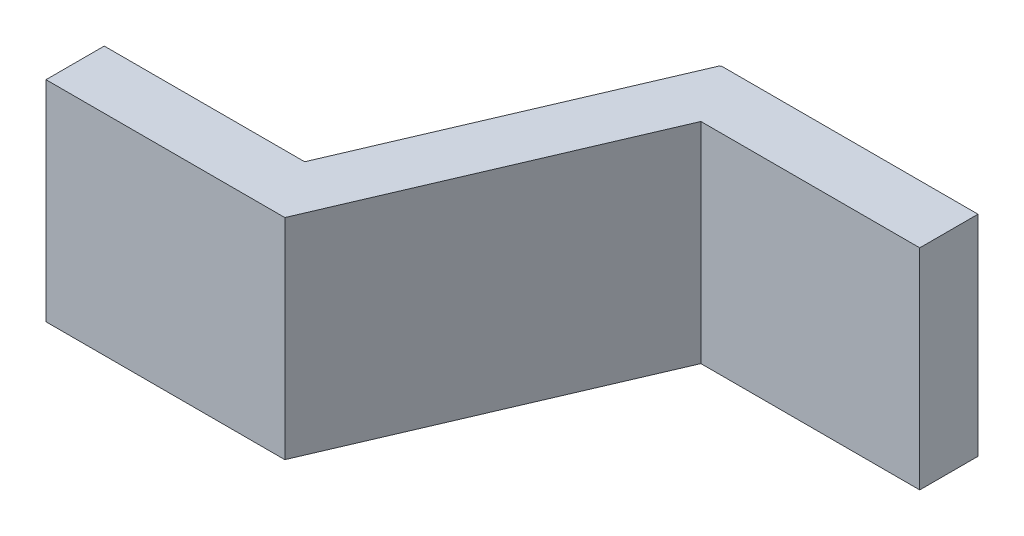
ISO-10303-21;
HEADER;
FILE_DESCRIPTION(('STEP AP214'),'2;1');
FILE_NAME('part.step','',(''),(''),'','','');
FILE_SCHEMA(('AUTOMOTIVE_DESIGN { 1 0 10303 214 1 1 1 1 }'));
ENDSEC;
DATA;
#1=APPLICATION_CONTEXT('core data for automotive mechanical design processes');
#2=APPLICATION_PROTOCOL_DEFINITION('international standard','automotive_design',2000,#1);
#3=PRODUCT_CONTEXT('',#1,'mechanical');
#4=PRODUCT('Part','Part','',(#3));
#5=PRODUCT_RELATED_PRODUCT_CATEGORY('part','',(#4));
#6=PRODUCT_DEFINITION_FORMATION('','',#4);
#7=PRODUCT_DEFINITION_CONTEXT('part definition',#1,'design');
#8=PRODUCT_DEFINITION('design','',#6,#7);
#9=PRODUCT_DEFINITION_SHAPE('','',#8);
#10=(LENGTH_UNIT() NAMED_UNIT(*) SI_UNIT(.MILLI.,.METRE.));
#11=(NAMED_UNIT(*) PLANE_ANGLE_UNIT() SI_UNIT($,.RADIAN.));
#12=(NAMED_UNIT(*) SI_UNIT($,.STERADIAN.) SOLID_ANGLE_UNIT());
#13=UNCERTAINTY_MEASURE_WITH_UNIT(LENGTH_MEASURE(1.E-05),#10,'distance_accuracy_value','');
#14=(GEOMETRIC_REPRESENTATION_CONTEXT(3) GLOBAL_UNCERTAINTY_ASSIGNED_CONTEXT((#13)) GLOBAL_UNIT_ASSIGNED_CONTEXT((#10,
#11,#12)) REPRESENTATION_CONTEXT('',''));
#15=CARTESIAN_POINT('',(0.,0.,0.));
#16=DIRECTION('',(0.,0.,1.));
#17=DIRECTION('',(1.,0.,0.));
#18=AXIS2_PLACEMENT_3D('',#15,#16,#17);
#19=CARTESIAN_POINT('',(11.558086453539,5.82,0.0006058345056003));
#20=DIRECTION('',(-0.919135450912914,0.,-0.393941649073963));
#21=DIRECTION('',(-0.393941649073963,0.,0.919135450912914));
#22=AXIS2_PLACEMENT_3D('',#19,#20,#21);
#23=PLANE('',#22);
#24=DIRECTION('',(0.,1.,0.));
#25=VECTOR('',#24,1.);
#26=CARTESIAN_POINT('',(11.344046008361,5.82,0.5));
#27=LINE('',#26,#25);
#28=CARTESIAN_POINT('',(11.344046008361,5.82,0.5));
#29=VERTEX_POINT('',#28);
#30=CARTESIAN_POINT('',(11.344046008361,6.180000014305,0.5));
#31=VERTEX_POINT('',#30);
#32=EDGE_CURVE('E94',#29,#31,#27,.T.);
#33=ORIENTED_EDGE('',*,*,#32,.T.);
#34=DIRECTION('',(-0.393941649073123,0.,0.919135450913275));
#35=VECTOR('',#34,1.);
#36=CARTESIAN_POINT('',(11.558086453539,6.180000014305,0.000605834505600302));
#37=LINE('',#36,#35);
#38=CARTESIAN_POINT('',(11.558086453539,6.180000014305,0.000605834505577237));
#39=VERTEX_POINT('',#38);
#40=EDGE_CURVE('E121',#39,#31,#37,.T.);
#41=ORIENTED_EDGE('',*,*,#40,.F.);
#42=DIRECTION('',(0.,1.,0.));
#43=VECTOR('',#42,1.);
#44=CARTESIAN_POINT('',(11.558086453539,5.82,0.000605834505554305));
#45=LINE('',#44,#43);
#46=CARTESIAN_POINT('',(11.558086453539,5.82,0.000605834505584969));
#47=VERTEX_POINT('',#46);
#48=EDGE_CURVE('E110',#39,#47,#45,.F.);
#49=ORIENTED_EDGE('',*,*,#48,.T.);
#50=DIRECTION('',(-0.393941649073123,0.,0.919135450913275));
#51=VECTOR('',#50,1.);
#52=CARTESIAN_POINT('',(11.558086453539,5.82,0.000605834505600302));
#53=LINE('',#52,#51);
#54=EDGE_CURVE('E100',#47,#29,#53,.T.);
#55=ORIENTED_EDGE('',*,*,#54,.T.);
#56=EDGE_LOOP('',(#33,#41,#49,#55));
#57=FACE_BOUND('',#56,.T.);
#58=ADVANCED_FACE('F17',(#57),#23,.T.);
#59=CARTESIAN_POINT('',(11.,5.82,0.5));
#60=DIRECTION('',(0.,0.,1.));
#61=DIRECTION('',(1.,0.,0.));
#62=AXIS2_PLACEMENT_3D('',#59,#60,#61);
#63=PLANE('',#62);
#64=DIRECTION('',(1.,0.,0.));
#65=VECTOR('',#64,1.);
#66=CARTESIAN_POINT('',(11.65,6.180000014305,0.5));
#67=LINE('',#66,#65);
#68=CARTESIAN_POINT('',(11.,6.180000014305,0.5));
#69=VERTEX_POINT('',#68);
#70=EDGE_CURVE('E79',#31,#69,#67,.F.);
#71=ORIENTED_EDGE('',*,*,#70,.F.);
#72=ORIENTED_EDGE('',*,*,#32,.F.);
#73=DIRECTION('',(1.,0.,0.));
#74=VECTOR('',#73,1.);
#75=CARTESIAN_POINT('',(11.65,5.82,0.5));
#76=LINE('',#75,#74);
#77=CARTESIAN_POINT('',(11.,5.82,0.5));
#78=VERTEX_POINT('',#77);
#79=EDGE_CURVE('E169',#29,#78,#76,.F.);
#80=ORIENTED_EDGE('',*,*,#79,.T.);
#81=DIRECTION('',(0.,1.,0.));
#82=VECTOR('',#81,1.);
#83=CARTESIAN_POINT('',(11.,5.82,0.5));
#84=LINE('',#83,#82);
#85=EDGE_CURVE('E87',#78,#69,#84,.T.);
#86=ORIENTED_EDGE('',*,*,#85,.T.);
#87=EDGE_LOOP('',(#71,#72,#80,#86));
#88=FACE_BOUND('',#87,.T.);
#89=ADVANCED_FACE('F198',(#88),#63,.F.);
#90=CARTESIAN_POINT('',(11.,5.82,0.5));
#91=DIRECTION('',(1.,0.,0.));
#92=DIRECTION('',(0.,0.,-1.));
#93=AXIS2_PLACEMENT_3D('',#90,#91,#92);
#94=PLANE('',#93);
#95=ORIENTED_EDGE('',*,*,#85,.F.);
#96=DIRECTION('',(0.,0.,1.));
#97=VECTOR('',#96,1.);
#98=CARTESIAN_POINT('',(11.,5.82,0.04));
#99=LINE('',#98,#97);
#100=CARTESIAN_POINT('',(11.,5.82,0.60000000149));
#101=VERTEX_POINT('',#100);
#102=EDGE_CURVE('E153',#78,#101,#99,.T.);
#103=ORIENTED_EDGE('',*,*,#102,.T.);
#104=DIRECTION('',(0.,1.,0.));
#105=VECTOR('',#104,1.);
#106=CARTESIAN_POINT('',(11.,5.82,0.60000000149));
#107=LINE('',#106,#105);
#108=CARTESIAN_POINT('',(11.,6.180000014305,0.60000000149));
#109=VERTEX_POINT('',#108);
#110=EDGE_CURVE('E117',#109,#101,#107,.F.);
#111=ORIENTED_EDGE('',*,*,#110,.F.);
#112=DIRECTION('',(0.,0.,1.));
#113=VECTOR('',#112,1.);
#114=CARTESIAN_POINT('',(11.,6.180000014305,0.04));
#115=LINE('',#114,#113);
#116=EDGE_CURVE('E71',#69,#109,#115,.T.);
#117=ORIENTED_EDGE('',*,*,#116,.F.);
#118=EDGE_LOOP('',(#95,#103,#111,#117));
#119=FACE_BOUND('',#118,.T.);
#120=ADVANCED_FACE('F202',(#119),#94,.F.);
#121=CARTESIAN_POINT('',(11.999999997616,5.82,0.));
#122=DIRECTION('',(1.,0.,0.));
#123=DIRECTION('',(0.,0.,-1.));
#124=AXIS2_PLACEMENT_3D('',#121,#122,#123);
#125=PLANE('',#124);
#126=DIRECTION('',(0.,0.,1.));
#127=VECTOR('',#126,1.);
#128=CARTESIAN_POINT('',(11.999999997616,5.82,0.04));
#129=LINE('',#128,#127);
#130=CARTESIAN_POINT('',(11.999999997616,5.82,0.10000000149));
#131=VERTEX_POINT('',#130);
#132=CARTESIAN_POINT('',(11.999999997616,5.82,0.));
#133=VERTEX_POINT('',#132);
#134=EDGE_CURVE('E179',#131,#133,#129,.F.);
#135=ORIENTED_EDGE('',*,*,#134,.T.);
#136=DIRECTION('',(0.,1.,0.));
#137=VECTOR('',#136,1.);
#138=CARTESIAN_POINT('',(11.999999997616,5.82,0.));
#139=LINE('',#138,#137);
#140=CARTESIAN_POINT('',(11.999999997616,6.180000014305,0.));
#141=VERTEX_POINT('',#140);
#142=EDGE_CURVE('E174',#133,#141,#139,.T.);
#143=ORIENTED_EDGE('',*,*,#142,.T.);
#144=DIRECTION('',(0.,0.,1.));
#145=VECTOR('',#144,1.);
#146=CARTESIAN_POINT('',(11.999999997616,6.180000014305,0.04));
#147=LINE('',#146,#145);
#148=CARTESIAN_POINT('',(11.999999997616,6.180000014305,0.10000000149));
#149=VERTEX_POINT('',#148);
#150=EDGE_CURVE('E155',#149,#141,#147,.F.);
#151=ORIENTED_EDGE('',*,*,#150,.F.);
#152=DIRECTION('',(0.,1.,0.));
#153=VECTOR('',#152,1.);
#154=CARTESIAN_POINT('',(11.999999997616,5.82,0.10000000149));
#155=LINE('',#154,#153);
#156=EDGE_CURVE('E125',#131,#149,#155,.T.);
#157=ORIENTED_EDGE('',*,*,#156,.F.);
#158=EDGE_LOOP('',(#135,#143,#151,#157));
#159=FACE_BOUND('',#158,.T.);
#160=ADVANCED_FACE('F228',(#159),#125,.T.);
#161=CARTESIAN_POINT('',(11.56,5.82,0.));
#162=DIRECTION('',(0.,0.,1.));
#163=DIRECTION('',(1.,0.,0.));
#164=AXIS2_PLACEMENT_3D('',#161,#162,#163);
#165=PLANE('',#164);
#166=DIRECTION('',(1.,0.,0.));
#167=VECTOR('',#166,1.);
#168=CARTESIAN_POINT('',(11.65,5.82,0.));
#169=LINE('',#168,#167);
#170=CARTESIAN_POINT('',(11.56,5.82,0.));
#171=VERTEX_POINT('',#170);
#172=EDGE_CURVE('E150',#133,#171,#169,.F.);
#173=ORIENTED_EDGE('',*,*,#172,.T.);
#174=DIRECTION('',(0.,1.,0.));
#175=VECTOR('',#174,1.);
#176=CARTESIAN_POINT('',(11.56,5.82,0.));
#177=LINE('',#176,#175);
#178=CARTESIAN_POINT('',(11.56,6.180000014305,0.));
#179=VERTEX_POINT('',#178);
#180=EDGE_CURVE('E164',#171,#179,#177,.T.);
#181=ORIENTED_EDGE('',*,*,#180,.T.);
#182=DIRECTION('',(1.,0.,0.));
#183=VECTOR('',#182,1.);
#184=CARTESIAN_POINT('',(11.65,6.180000014305,0.));
#185=LINE('',#184,#183);
#186=EDGE_CURVE('E154',#141,#179,#185,.F.);
#187=ORIENTED_EDGE('',*,*,#186,.F.);
#188=ORIENTED_EDGE('',*,*,#142,.F.);
#189=EDGE_LOOP('',(#173,#181,#187,#188));
#190=FACE_BOUND('',#189,.T.);
#191=ADVANCED_FACE('F232',(#190),#165,.F.);
#192=CARTESIAN_POINT('',(11.56,5.82,0.));
#193=DIRECTION('',(1.,0.,0.));
#194=DIRECTION('',(0.,0.,-1.));
#195=AXIS2_PLACEMENT_3D('',#192,#193,#194);
#196=PLANE('',#195);
#197=DIRECTION('',(0.,1.,0.));
#198=VECTOR('',#197,1.);
#199=CARTESIAN_POINT('',(11.56,5.82,0.00142598092431268));
#200=LINE('',#199,#198);
#201=CARTESIAN_POINT('',(11.56,5.82,0.00142598092431734));
#202=VERTEX_POINT('',#201);
#203=CARTESIAN_POINT('',(11.56,6.180000014305,0.00142598092431734));
#204=VERTEX_POINT('',#203);
#205=EDGE_CURVE('E118',#202,#204,#200,.T.);
#206=ORIENTED_EDGE('',*,*,#205,.T.);
#207=DIRECTION('',(0.,0.,1.));
#208=VECTOR('',#207,1.);
#209=CARTESIAN_POINT('',(11.56,6.180000014305,0.04));
#210=LINE('',#209,#208);
#211=EDGE_CURVE('E123',#179,#204,#210,.T.);
#212=ORIENTED_EDGE('',*,*,#211,.F.);
#213=ORIENTED_EDGE('',*,*,#180,.F.);
#214=DIRECTION('',(0.,0.,-1.));
#215=VECTOR('',#214,1.);
#216=CARTESIAN_POINT('',(11.56,5.82,0.));
#217=LINE('',#216,#215);
#218=EDGE_CURVE('E147',#171,#202,#217,.F.);
#219=ORIENTED_EDGE('',*,*,#218,.T.);
#220=EDGE_LOOP('',(#206,#212,#213,#219));
#221=FACE_BOUND('',#220,.T.);
#222=ADVANCED_FACE('F234',(#221),#196,.F.);
#223=CARTESIAN_POINT('',(11.65,5.82,0.04));
#224=DIRECTION('',(-0.393941649073963,0.,0.919135450912914));
#225=DIRECTION('',(0.919135450912914,0.,0.393941649073963));
#226=AXIS2_PLACEMENT_3D('',#223,#224,#225);
#227=PLANE('',#226);
#228=DIRECTION('',(-0.919135450920459,0.,-0.393941649056361));
#229=VECTOR('',#228,1.);
#230=CARTESIAN_POINT('',(11.56,6.180000014305,0.001425980924322));
#231=LINE('',#230,#229);
#232=EDGE_CURVE('E113',#204,#39,#231,.T.);
#233=ORIENTED_EDGE('',*,*,#232,.F.);
#234=ORIENTED_EDGE('',*,*,#205,.F.);
#235=DIRECTION('',(-0.919135450920459,0.,-0.393941649056361));
#236=VECTOR('',#235,1.);
#237=CARTESIAN_POINT('',(11.56,5.82,0.001425980924322));
#238=LINE('',#237,#236);
#239=EDGE_CURVE('E114',#202,#47,#238,.T.);
#240=ORIENTED_EDGE('',*,*,#239,.T.);
#241=ORIENTED_EDGE('',*,*,#48,.F.);
#242=EDGE_LOOP('',(#233,#234,#240,#241));
#243=FACE_BOUND('',#242,.T.);
#244=ADVANCED_FACE('F112',(#243),#227,.F.);
#245=CARTESIAN_POINT('',(11.,5.82,0.60000000149));
#246=DIRECTION('',(0.,0.,1.));
#247=DIRECTION('',(1.,0.,0.));
#248=AXIS2_PLACEMENT_3D('',#245,#246,#247);
#249=PLANE('',#248);
#250=DIRECTION('',(0.,1.,0.));
#251=VECTOR('',#250,1.);
#252=CARTESIAN_POINT('',(11.4099838806682,5.82,0.60000000149));
#253=LINE('',#252,#251);
#254=CARTESIAN_POINT('',(11.4099838806682,5.82,0.60000000149));
#255=VERTEX_POINT('',#254);
#256=CARTESIAN_POINT('',(11.4099838806682,6.180000014305,0.60000000149));
#257=VERTEX_POINT('',#256);
#258=EDGE_CURVE('E144',#255,#257,#253,.T.);
#259=ORIENTED_EDGE('',*,*,#258,.T.);
#260=DIRECTION('',(1.,0.,0.));
#261=VECTOR('',#260,1.);
#262=CARTESIAN_POINT('',(11.65,6.180000014305,0.60000000149));
#263=LINE('',#262,#261);
#264=EDGE_CURVE('E20',#109,#257,#263,.T.);
#265=ORIENTED_EDGE('',*,*,#264,.F.);
#266=ORIENTED_EDGE('',*,*,#110,.T.);
#267=DIRECTION('',(1.,0.,0.));
#268=VECTOR('',#267,1.);
#269=CARTESIAN_POINT('',(11.,5.82,0.60000000149));
#270=LINE('',#269,#268);
#271=EDGE_CURVE('E151',#101,#255,#270,.T.);
#272=ORIENTED_EDGE('',*,*,#271,.T.);
#273=EDGE_LOOP('',(#259,#265,#266,#272));
#274=FACE_BOUND('',#273,.T.);
#275=ADVANCED_FACE('F205',(#274),#249,.T.);
#276=CARTESIAN_POINT('',(11.65,6.180000014305,0.04));
#277=DIRECTION('',(0.,1.,0.));
#278=DIRECTION('',(0.,0.,1.));
#279=AXIS2_PLACEMENT_3D('',#276,#277,#278);
#280=PLANE('',#279);
#281=ORIENTED_EDGE('',*,*,#211,.T.);
#282=ORIENTED_EDGE('',*,*,#232,.T.);
#283=ORIENTED_EDGE('',*,*,#40,.T.);
#284=ORIENTED_EDGE('',*,*,#70,.T.);
#285=ORIENTED_EDGE('',*,*,#116,.T.);
#286=ORIENTED_EDGE('',*,*,#264,.T.);
#287=DIRECTION('',(-0.393941649073964,0.,0.919135450912914));
#288=VECTOR('',#287,1.);
#289=CARTESIAN_POINT('',(11.6242839866442,6.180000014305,0.100000001490094));
#290=LINE('',#289,#288);
#291=CARTESIAN_POINT('',(11.6242839866442,6.180000014305,0.100000001490047));
#292=VERTEX_POINT('',#291);
#293=EDGE_CURVE('E141',#257,#292,#290,.F.);
#294=ORIENTED_EDGE('',*,*,#293,.T.);
#295=DIRECTION('',(1.,0.,0.));
#296=VECTOR('',#295,1.);
#297=CARTESIAN_POINT('',(11.56,6.180000014305,0.10000000149));
#298=LINE('',#297,#296);
#299=EDGE_CURVE('E170',#149,#292,#298,.F.);
#300=ORIENTED_EDGE('',*,*,#299,.F.);
#301=ORIENTED_EDGE('',*,*,#150,.T.);
#302=ORIENTED_EDGE('',*,*,#186,.T.);
#303=EDGE_LOOP('',(#281,#282,#283,#284,#285,#286,#294,#300,#301,#302));
#304=FACE_BOUND('',#303,.T.);
#305=ADVANCED_FACE('F120',(#304),#280,.T.);
#306=CARTESIAN_POINT('',(11.56,5.82,0.10000000149));
#307=DIRECTION('',(0.,0.,1.));
#308=DIRECTION('',(1.,0.,0.));
#309=AXIS2_PLACEMENT_3D('',#306,#307,#308);
#310=PLANE('',#309);
#311=ORIENTED_EDGE('',*,*,#299,.T.);
#312=DIRECTION('',(0.,1.,0.));
#313=VECTOR('',#312,1.);
#314=CARTESIAN_POINT('',(11.6242839866442,5.82,0.100000001490094));
#315=LINE('',#314,#313);
#316=CARTESIAN_POINT('',(11.6242839866442,5.82,0.100000001490047));
#317=VERTEX_POINT('',#316);
#318=EDGE_CURVE('E26',#292,#317,#315,.F.);
#319=ORIENTED_EDGE('',*,*,#318,.T.);
#320=DIRECTION('',(1.,0.,0.));
#321=VECTOR('',#320,1.);
#322=CARTESIAN_POINT('',(11.65,5.82,0.10000000149));
#323=LINE('',#322,#321);
#324=EDGE_CURVE('E34',#317,#131,#323,.T.);
#325=ORIENTED_EDGE('',*,*,#324,.T.);
#326=ORIENTED_EDGE('',*,*,#156,.T.);
#327=EDGE_LOOP('',(#311,#319,#325,#326));
#328=FACE_BOUND('',#327,.T.);
#329=ADVANCED_FACE('F223',(#328),#310,.T.);
#330=CARTESIAN_POINT('',(11.65,5.82,0.04));
#331=DIRECTION('',(0.,1.,0.));
#332=DIRECTION('',(0.,0.,1.));
#333=AXIS2_PLACEMENT_3D('',#330,#331,#332);
#334=PLANE('',#333);
#335=ORIENTED_EDGE('',*,*,#218,.F.);
#336=ORIENTED_EDGE('',*,*,#172,.F.);
#337=ORIENTED_EDGE('',*,*,#134,.F.);
#338=ORIENTED_EDGE('',*,*,#324,.F.);
#339=DIRECTION('',(0.393941649073964,0.,-0.919135450912914));
#340=VECTOR('',#339,1.);
#341=CARTESIAN_POINT('',(11.4098164411035,5.82,0.600390667570103));
#342=LINE('',#341,#340);
#343=EDGE_CURVE('E11',#317,#255,#342,.F.);
#344=ORIENTED_EDGE('',*,*,#343,.T.);
#345=ORIENTED_EDGE('',*,*,#271,.F.);
#346=ORIENTED_EDGE('',*,*,#102,.F.);
#347=ORIENTED_EDGE('',*,*,#79,.F.);
#348=ORIENTED_EDGE('',*,*,#54,.F.);
#349=ORIENTED_EDGE('',*,*,#239,.F.);
#350=EDGE_LOOP('',(#335,#336,#337,#338,#344,#345,#346,#347,#348,#349));
#351=FACE_BOUND('',#350,.T.);
#352=ADVANCED_FACE('F200',(#351),#334,.F.);
#353=CARTESIAN_POINT('',(11.65,5.82,0.04));
#354=DIRECTION('',(-0.919135450912914,0.,-0.393941649073963));
#355=DIRECTION('',(-0.393941649073963,0.,0.919135450912914));
#356=AXIS2_PLACEMENT_3D('',#353,#354,#355);
#357=PLANE('',#356);
#358=ORIENTED_EDGE('',*,*,#318,.F.);
#359=ORIENTED_EDGE('',*,*,#293,.F.);
#360=ORIENTED_EDGE('',*,*,#258,.F.);
#361=ORIENTED_EDGE('',*,*,#343,.F.);
#362=EDGE_LOOP('',(#358,#359,#360,#361));
#363=FACE_BOUND('',#362,.T.);
#364=ADVANCED_FACE('F210',(#363),#357,.F.);
#365=CLOSED_SHELL('',(#58,#89,#120,#160,#191,#222,#244,#275,#305,#329,#352,#364));
#366=MANIFOLD_SOLID_BREP('B1',#365);
#367=ADVANCED_BREP_SHAPE_REPRESENTATION('',(#18,#366),#14);
#368=SHAPE_DEFINITION_REPRESENTATION(#9,#367);
ENDSEC;
END-ISO-10303-21;
